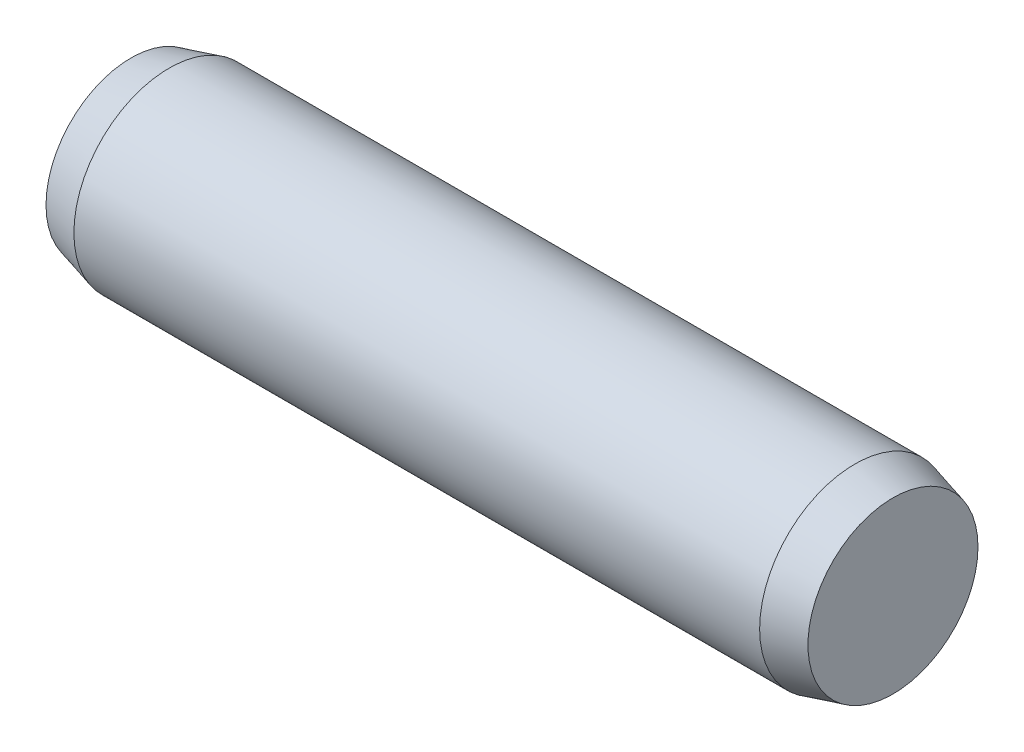
ISO-10303-21;
HEADER;
FILE_DESCRIPTION(('STEP AP214'),'2;1');
FILE_NAME('part.step','',(''),(''),'','','');
FILE_SCHEMA(('AUTOMOTIVE_DESIGN { 1 0 10303 214 1 1 1 1 }'));
ENDSEC;
DATA;
#1=APPLICATION_CONTEXT('core data for automotive mechanical design processes');
#2=APPLICATION_PROTOCOL_DEFINITION('international standard','automotive_design',2000,#1);
#3=PRODUCT_CONTEXT('',#1,'mechanical');
#4=PRODUCT('Part','Part','',(#3));
#5=PRODUCT_RELATED_PRODUCT_CATEGORY('part','',(#4));
#6=PRODUCT_DEFINITION_FORMATION('','',#4);
#7=PRODUCT_DEFINITION_CONTEXT('part definition',#1,'design');
#8=PRODUCT_DEFINITION('design','',#6,#7);
#9=PRODUCT_DEFINITION_SHAPE('','',#8);
#10=(LENGTH_UNIT() NAMED_UNIT(*) SI_UNIT(.MILLI.,.METRE.));
#11=(NAMED_UNIT(*) PLANE_ANGLE_UNIT() SI_UNIT($,.RADIAN.));
#12=(NAMED_UNIT(*) SI_UNIT($,.STERADIAN.) SOLID_ANGLE_UNIT());
#13=UNCERTAINTY_MEASURE_WITH_UNIT(LENGTH_MEASURE(1.E-05),#10,'distance_accuracy_value','');
#14=(GEOMETRIC_REPRESENTATION_CONTEXT(3) GLOBAL_UNCERTAINTY_ASSIGNED_CONTEXT((#13)) GLOBAL_UNIT_ASSIGNED_CONTEXT((#10,
#11,#12)) REPRESENTATION_CONTEXT('',''));
#15=CARTESIAN_POINT('',(0.,0.,0.));
#16=DIRECTION('',(0.,0.,1.));
#17=DIRECTION('',(1.,0.,0.));
#18=AXIS2_PLACEMENT_3D('',#15,#16,#17);
#19=CARTESIAN_POINT('',(-2.7,0.,0.));
#20=DIRECTION('',(1.,0.,0.));
#21=DIRECTION('',(0.,0.,-1.));
#22=AXIS2_PLACEMENT_3D('',#19,#20,#21);
#23=CYLINDRICAL_SURFACE('',#22,0.75);
#24=CARTESIAN_POINT('',(-2.7,0.,0.));
#25=DIRECTION('',(-1.,0.,0.));
#26=DIRECTION('',(0.,0.,1.));
#27=AXIS2_PLACEMENT_3D('',#24,#25,#26);
#28=CIRCLE('',#27,0.75);
#29=CARTESIAN_POINT('',(-2.7,0.,0.75));
#30=VERTEX_POINT('',#29);
#31=EDGE_CURVE('E46',#30,#30,#28,.T.);
#32=ORIENTED_EDGE('',*,*,#31,.F.);
#33=EDGE_LOOP('',(#32));
#34=FACE_BOUND('',#33,.T.);
#35=CARTESIAN_POINT('',(2.7,0.,0.));
#36=DIRECTION('',(1.,0.,0.));
#37=DIRECTION('',(0.,0.,-1.));
#38=AXIS2_PLACEMENT_3D('',#35,#36,#37);
#39=CIRCLE('',#38,0.75);
#40=CARTESIAN_POINT('',(2.7,0.,-0.75));
#41=VERTEX_POINT('',#40);
#42=EDGE_CURVE('E10',#41,#41,#39,.T.);
#43=ORIENTED_EDGE('',*,*,#42,.F.);
#44=EDGE_LOOP('',(#43));
#45=FACE_BOUND('',#44,.T.);
#46=ADVANCED_FACE('F32',(#34,#45),#23,.T.);
#47=CARTESIAN_POINT('',(2.7,0.,0.));
#48=DIRECTION('',(-1.,0.,0.));
#49=DIRECTION('',(0.,0.,-1.));
#50=AXIS2_PLACEMENT_3D('',#47,#48,#49);
#51=CONICAL_SURFACE('',#50,0.75,0.26179938779915);
#52=CARTESIAN_POINT('',(3.,0.,0.));
#53=DIRECTION('',(1.,0.,0.));
#54=DIRECTION('',(0.,0.,-1.));
#55=AXIS2_PLACEMENT_3D('',#52,#53,#54);
#56=CIRCLE('',#55,0.669615242270663);
#57=CARTESIAN_POINT('',(3.,0.,-0.669615242270663));
#58=VERTEX_POINT('',#57);
#59=EDGE_CURVE('E38',#58,#58,#56,.T.);
#60=ORIENTED_EDGE('',*,*,#59,.F.);
#61=EDGE_LOOP('',(#60));
#62=FACE_BOUND('',#61,.T.);
#63=ORIENTED_EDGE('',*,*,#42,.T.);
#64=EDGE_LOOP('',(#63));
#65=FACE_BOUND('',#64,.T.);
#66=ADVANCED_FACE('F56',(#62,#65),#51,.T.);
#67=CARTESIAN_POINT('',(3.,0.,0.));
#68=DIRECTION('',(1.,0.,0.));
#69=DIRECTION('',(0.,0.,-1.));
#70=AXIS2_PLACEMENT_3D('',#67,#68,#69);
#71=PLANE('',#70);
#72=ORIENTED_EDGE('',*,*,#59,.T.);
#73=EDGE_LOOP('',(#72));
#74=FACE_BOUND('',#73,.T.);
#75=ADVANCED_FACE('F60',(#74),#71,.T.);
#76=CARTESIAN_POINT('',(-2.7,0.,0.));
#77=DIRECTION('',(1.,0.,0.));
#78=DIRECTION('',(0.,0.,1.));
#79=AXIS2_PLACEMENT_3D('',#76,#77,#78);
#80=CONICAL_SURFACE('',#79,0.75,0.26179938779915);
#81=CARTESIAN_POINT('',(-3.,0.,0.));
#82=DIRECTION('',(-1.,0.,0.));
#83=DIRECTION('',(0.,0.,1.));
#84=AXIS2_PLACEMENT_3D('',#81,#82,#83);
#85=CIRCLE('',#84,0.669615242270663);
#86=CARTESIAN_POINT('',(-3.,0.,0.669615242270663));
#87=VERTEX_POINT('',#86);
#88=EDGE_CURVE('E42',#87,#87,#85,.T.);
#89=ORIENTED_EDGE('',*,*,#88,.F.);
#90=EDGE_LOOP('',(#89));
#91=FACE_BOUND('',#90,.T.);
#92=ORIENTED_EDGE('',*,*,#31,.T.);
#93=EDGE_LOOP('',(#92));
#94=FACE_BOUND('',#93,.T.);
#95=ADVANCED_FACE('F52',(#91,#94),#80,.T.);
#96=CARTESIAN_POINT('',(-3.,0.,0.));
#97=DIRECTION('',(-1.,0.,0.));
#98=DIRECTION('',(0.,0.,1.));
#99=AXIS2_PLACEMENT_3D('',#96,#97,#98);
#100=PLANE('',#99);
#101=ORIENTED_EDGE('',*,*,#88,.T.);
#102=EDGE_LOOP('',(#101));
#103=FACE_BOUND('',#102,.T.);
#104=ADVANCED_FACE('F69',(#103),#100,.T.);
#105=CLOSED_SHELL('',(#46,#66,#75,#95,#104));
#106=MANIFOLD_SOLID_BREP('B2',#105);
#107=ADVANCED_BREP_SHAPE_REPRESENTATION('',(#18,#106),#14);
#108=SHAPE_DEFINITION_REPRESENTATION(#9,#107);
ENDSEC;
END-ISO-10303-21;
